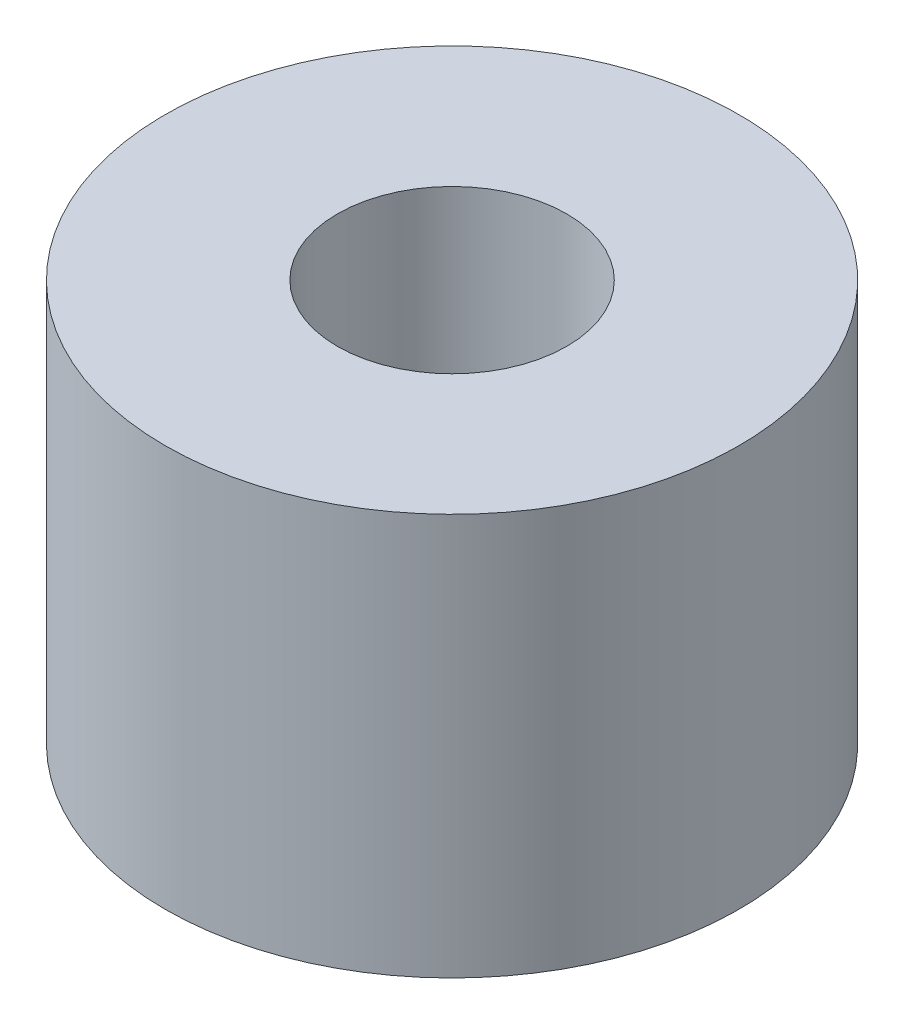
ISO-10303-21;
HEADER;
FILE_DESCRIPTION(('STEP AP214'),'2;1');
FILE_NAME('part.step','',(''),(''),'','','');
FILE_SCHEMA(('AUTOMOTIVE_DESIGN { 1 0 10303 214 1 1 1 1 }'));
ENDSEC;
DATA;
#1=APPLICATION_CONTEXT('core data for automotive mechanical design processes');
#2=APPLICATION_PROTOCOL_DEFINITION('international standard','automotive_design',2000,#1);
#3=PRODUCT_CONTEXT('',#1,'mechanical');
#4=PRODUCT('Part','Part','',(#3));
#5=PRODUCT_RELATED_PRODUCT_CATEGORY('part','',(#4));
#6=PRODUCT_DEFINITION_FORMATION('','',#4);
#7=PRODUCT_DEFINITION_CONTEXT('part definition',#1,'design');
#8=PRODUCT_DEFINITION('design','',#6,#7);
#9=PRODUCT_DEFINITION_SHAPE('','',#8);
#10=(LENGTH_UNIT() NAMED_UNIT(*) SI_UNIT(.MILLI.,.METRE.));
#11=(NAMED_UNIT(*) PLANE_ANGLE_UNIT() SI_UNIT($,.RADIAN.));
#12=(NAMED_UNIT(*) SI_UNIT($,.STERADIAN.) SOLID_ANGLE_UNIT());
#13=UNCERTAINTY_MEASURE_WITH_UNIT(LENGTH_MEASURE(1.E-05),#10,'distance_accuracy_value','');
#14=(GEOMETRIC_REPRESENTATION_CONTEXT(3) GLOBAL_UNCERTAINTY_ASSIGNED_CONTEXT((#13)) GLOBAL_UNIT_ASSIGNED_CONTEXT((#10,
#11,#12)) REPRESENTATION_CONTEXT('',''));
#15=CARTESIAN_POINT('',(0.,0.,0.));
#16=DIRECTION('',(0.,0.,1.));
#17=DIRECTION('',(1.,0.,0.));
#18=AXIS2_PLACEMENT_3D('',#15,#16,#17);
#19=CARTESIAN_POINT('',(0.,35.,0.));
#20=DIRECTION('',(0.,-1.,0.));
#21=DIRECTION('',(0.,0.,-1.));
#22=AXIS2_PLACEMENT_3D('',#19,#20,#21);
#23=CYLINDRICAL_SURFACE('',#22,25.);
#24=CARTESIAN_POINT('',(0.,35.,0.));
#25=DIRECTION('',(0.,1.,0.));
#26=DIRECTION('',(0.,0.,1.));
#27=AXIS2_PLACEMENT_3D('',#24,#25,#26);
#28=CIRCLE('',#27,25.);
#29=CARTESIAN_POINT('',(0.,35.,25.));
#30=VERTEX_POINT('',#29);
#31=EDGE_CURVE('E11',#30,#30,#28,.T.);
#32=ORIENTED_EDGE('',*,*,#31,.F.);
#33=EDGE_LOOP('',(#32));
#34=FACE_BOUND('',#33,.T.);
#35=CARTESIAN_POINT('',(0.,0.,0.));
#36=DIRECTION('',(0.,1.,0.));
#37=DIRECTION('',(0.,0.,1.));
#38=AXIS2_PLACEMENT_3D('',#35,#36,#37);
#39=CIRCLE('',#38,25.);
#40=CARTESIAN_POINT('',(0.,0.,25.));
#41=VERTEX_POINT('',#40);
#42=EDGE_CURVE('E40',#41,#41,#39,.T.);
#43=ORIENTED_EDGE('',*,*,#42,.T.);
#44=EDGE_LOOP('',(#43));
#45=FACE_BOUND('',#44,.T.);
#46=ADVANCED_FACE('F37',(#34,#45),#23,.T.);
#47=CARTESIAN_POINT('',(0.,35.,0.));
#48=DIRECTION('',(0.,1.,0.));
#49=DIRECTION('',(0.,0.,1.));
#50=AXIS2_PLACEMENT_3D('',#47,#48,#49);
#51=PLANE('',#50);
#52=CARTESIAN_POINT('',(0.,35.,0.));
#53=DIRECTION('',(0.,1.,0.));
#54=DIRECTION('',(0.,0.,1.));
#55=AXIS2_PLACEMENT_3D('',#52,#53,#54);
#56=CIRCLE('',#55,10.);
#57=CARTESIAN_POINT('',(0.,35.,10.));
#58=VERTEX_POINT('',#57);
#59=EDGE_CURVE('E81',#58,#58,#56,.T.);
#60=ORIENTED_EDGE('',*,*,#59,.F.);
#61=EDGE_LOOP('',(#60));
#62=FACE_BOUND('',#61,.T.);
#63=ORIENTED_EDGE('',*,*,#31,.T.);
#64=EDGE_LOOP('',(#63));
#65=FACE_BOUND('',#64,.T.);
#66=ADVANCED_FACE('F90',(#62,#65),#51,.T.);
#67=CARTESIAN_POINT('',(0.,0.,0.));
#68=DIRECTION('',(0.,1.,0.));
#69=DIRECTION('',(0.,0.,1.));
#70=AXIS2_PLACEMENT_3D('',#67,#68,#69);
#71=PLANE('',#70);
#72=CARTESIAN_POINT('',(-17.5,0.,0.));
#73=DIRECTION('',(0.,-1.,0.));
#74=DIRECTION('',(0.,0.,-1.));
#75=AXIS2_PLACEMENT_3D('',#72,#73,#74);
#76=CIRCLE('',#75,2.49999999999999);
#77=CARTESIAN_POINT('',(-17.5,0.,-2.49999999999999));
#78=VERTEX_POINT('',#77);
#79=EDGE_CURVE('E65',#78,#78,#76,.T.);
#80=ORIENTED_EDGE('',*,*,#79,.F.);
#81=EDGE_LOOP('',(#80));
#82=FACE_BOUND('',#81,.T.);
#83=CARTESIAN_POINT('',(8.74846,0.,15.156333581325));
#84=DIRECTION('',(0.,-1.,0.));
#85=DIRECTION('',(0.,0.,-1.));
#86=AXIS2_PLACEMENT_3D('',#83,#84,#85);
#87=CIRCLE('',#86,2.49999999999999);
#88=CARTESIAN_POINT('',(8.74846,0.,12.656333581325));
#89=VERTEX_POINT('',#88);
#90=EDGE_CURVE('E64',#89,#89,#87,.T.);
#91=ORIENTED_EDGE('',*,*,#90,.F.);
#92=EDGE_LOOP('',(#91));
#93=FACE_BOUND('',#92,.T.);
#94=CARTESIAN_POINT('',(8.75307972896001,0.,-15.1536660666147));
#95=DIRECTION('',(0.,-1.,0.));
#96=DIRECTION('',(0.,0.,-1.));
#97=AXIS2_PLACEMENT_3D('',#94,#95,#96);
#98=CIRCLE('',#97,2.49999999999999);
#99=CARTESIAN_POINT('',(8.75307972896001,0.,-17.6536660666147));
#100=VERTEX_POINT('',#99);
#101=EDGE_CURVE('E75',#100,#100,#98,.T.);
#102=ORIENTED_EDGE('',*,*,#101,.F.);
#103=EDGE_LOOP('',(#102));
#104=FACE_BOUND('',#103,.T.);
#105=CARTESIAN_POINT('',(0.,0.,0.));
#106=DIRECTION('',(0.,1.,0.));
#107=DIRECTION('',(0.,0.,1.));
#108=AXIS2_PLACEMENT_3D('',#105,#106,#107);
#109=CIRCLE('',#108,10.);
#110=CARTESIAN_POINT('',(0.,0.,10.));
#111=VERTEX_POINT('',#110);
#112=EDGE_CURVE('E82',#111,#111,#109,.T.);
#113=ORIENTED_EDGE('',*,*,#112,.T.);
#114=EDGE_LOOP('',(#113));
#115=FACE_BOUND('',#114,.T.);
#116=ORIENTED_EDGE('',*,*,#42,.F.);
#117=EDGE_LOOP('',(#116));
#118=FACE_BOUND('',#117,.T.);
#119=ADVANCED_FACE('F93',(#82,#93,#104,#115,#118),#71,.F.);
#120=CARTESIAN_POINT('',(0.,0.,0.));
#121=DIRECTION('',(0.,1.,0.));
#122=DIRECTION('',(0.,0.,1.));
#123=AXIS2_PLACEMENT_3D('',#120,#121,#122);
#124=CYLINDRICAL_SURFACE('',#123,10.);
#125=ORIENTED_EDGE('',*,*,#112,.F.);
#126=EDGE_LOOP('',(#125));
#127=FACE_BOUND('',#126,.T.);
#128=ORIENTED_EDGE('',*,*,#59,.T.);
#129=EDGE_LOOP('',(#128));
#130=FACE_BOUND('',#129,.T.);
#131=ADVANCED_FACE('F88',(#127,#130),#124,.F.);
#132=CARTESIAN_POINT('',(8.75307972896001,20.,-15.1536660666147));
#133=DIRECTION('',(0.,-1.,0.));
#134=DIRECTION('',(0.,0.,-1.));
#135=AXIS2_PLACEMENT_3D('',#132,#133,#134);
#136=CONICAL_SURFACE('',#135,2.5,1.02974425867665);
#137=CARTESIAN_POINT('',(8.75307972896001,21.5021515475689,-15.1536660666147));
#138=VERTEX_POINT('',#137);
#139=VERTEX_LOOP('',#138);
#140=FACE_BOUND('',#139,.T.);
#141=CARTESIAN_POINT('',(8.75307972896001,20.,-15.1536660666147));
#142=DIRECTION('',(0.,-1.,0.));
#143=DIRECTION('',(0.,0.,-1.));
#144=AXIS2_PLACEMENT_3D('',#141,#142,#143);
#145=CIRCLE('',#144,2.5);
#146=CARTESIAN_POINT('',(8.75307972896001,20.,-17.6536660666147));
#147=VERTEX_POINT('',#146);
#148=EDGE_CURVE('E78',#147,#147,#145,.T.);
#149=ORIENTED_EDGE('',*,*,#148,.T.);
#150=EDGE_LOOP('',(#149));
#151=FACE_BOUND('',#150,.T.);
#152=ADVANCED_FACE('F107',(#140,#151),#136,.F.);
#153=CARTESIAN_POINT('',(8.75307972896001,0.,-15.1536660666147));
#154=DIRECTION('',(0.,-1.,0.));
#155=DIRECTION('',(0.,0.,-1.));
#156=AXIS2_PLACEMENT_3D('',#153,#154,#155);
#157=CYLINDRICAL_SURFACE('',#156,2.49999999999999);
#158=ORIENTED_EDGE('',*,*,#148,.F.);
#159=EDGE_LOOP('',(#158));
#160=FACE_BOUND('',#159,.T.);
#161=ORIENTED_EDGE('',*,*,#101,.T.);
#162=EDGE_LOOP('',(#161));
#163=FACE_BOUND('',#162,.T.);
#164=ADVANCED_FACE('F115',(#160,#163),#157,.F.);
#165=CARTESIAN_POINT('',(8.74846,20.,15.156333581325));
#166=DIRECTION('',(0.,-1.,0.));
#167=DIRECTION('',(0.,0.,-1.));
#168=AXIS2_PLACEMENT_3D('',#165,#166,#167);
#169=CONICAL_SURFACE('',#168,2.5,1.02974425867665);
#170=CARTESIAN_POINT('',(8.74845999999999,21.5021515475689,15.156333581325));
#171=VERTEX_POINT('',#170);
#172=VERTEX_LOOP('',#171);
#173=FACE_BOUND('',#172,.T.);
#174=CARTESIAN_POINT('',(8.74846,20.,15.156333581325));
#175=DIRECTION('',(0.,-1.,0.));
#176=DIRECTION('',(0.,0.,-1.));
#177=AXIS2_PLACEMENT_3D('',#174,#175,#176);
#178=CIRCLE('',#177,2.5);
#179=CARTESIAN_POINT('',(8.74846,20.,12.656333581325));
#180=VERTEX_POINT('',#179);
#181=EDGE_CURVE('E68',#180,#180,#178,.T.);
#182=ORIENTED_EDGE('',*,*,#181,.T.);
#183=EDGE_LOOP('',(#182));
#184=FACE_BOUND('',#183,.T.);
#185=ADVANCED_FACE('F118',(#173,#184),#169,.F.);
#186=CARTESIAN_POINT('',(8.74846,0.,15.156333581325));
#187=DIRECTION('',(0.,-1.,0.));
#188=DIRECTION('',(0.,0.,-1.));
#189=AXIS2_PLACEMENT_3D('',#186,#187,#188);
#190=CYLINDRICAL_SURFACE('',#189,2.49999999999999);
#191=ORIENTED_EDGE('',*,*,#181,.F.);
#192=EDGE_LOOP('',(#191));
#193=FACE_BOUND('',#192,.T.);
#194=ORIENTED_EDGE('',*,*,#90,.T.);
#195=EDGE_LOOP('',(#194));
#196=FACE_BOUND('',#195,.T.);
#197=ADVANCED_FACE('F58',(#193,#196),#190,.F.);
#198=CARTESIAN_POINT('',(-17.5,20.,0.));
#199=DIRECTION('',(0.,-1.,0.));
#200=DIRECTION('',(0.,0.,-1.));
#201=AXIS2_PLACEMENT_3D('',#198,#199,#200);
#202=CONICAL_SURFACE('',#201,2.5,1.02974425867665);
#203=CARTESIAN_POINT('',(-17.5,21.5021515475689,0.));
#204=VERTEX_POINT('',#203);
#205=VERTEX_LOOP('',#204);
#206=FACE_BOUND('',#205,.T.);
#207=CARTESIAN_POINT('',(-17.5,20.,0.));
#208=DIRECTION('',(0.,-1.,0.));
#209=DIRECTION('',(0.,0.,-1.));
#210=AXIS2_PLACEMENT_3D('',#207,#208,#209);
#211=CIRCLE('',#210,2.5);
#212=CARTESIAN_POINT('',(-17.5,20.,-2.5));
#213=VERTEX_POINT('',#212);
#214=EDGE_CURVE('E62',#213,#213,#211,.T.);
#215=ORIENTED_EDGE('',*,*,#214,.T.);
#216=EDGE_LOOP('',(#215));
#217=FACE_BOUND('',#216,.T.);
#218=ADVANCED_FACE('F54',(#206,#217),#202,.F.);
#219=CARTESIAN_POINT('',(-17.5,0.,0.));
#220=DIRECTION('',(0.,-1.,0.));
#221=DIRECTION('',(0.,0.,-1.));
#222=AXIS2_PLACEMENT_3D('',#219,#220,#221);
#223=CYLINDRICAL_SURFACE('',#222,2.49999999999999);
#224=ORIENTED_EDGE('',*,*,#214,.F.);
#225=EDGE_LOOP('',(#224));
#226=FACE_BOUND('',#225,.T.);
#227=ORIENTED_EDGE('',*,*,#79,.T.);
#228=EDGE_LOOP('',(#227));
#229=FACE_BOUND('',#228,.T.);
#230=ADVANCED_FACE('F57',(#226,#229),#223,.F.);
#231=CLOSED_SHELL('',(#46,#66,#119,#131,#152,#164,#185,#197,#218,#230));
#232=MANIFOLD_SOLID_BREP('B2',#231);
#233=ADVANCED_BREP_SHAPE_REPRESENTATION('',(#18,#232),#14);
#234=SHAPE_DEFINITION_REPRESENTATION(#9,#233);
ENDSEC;
END-ISO-10303-21;
